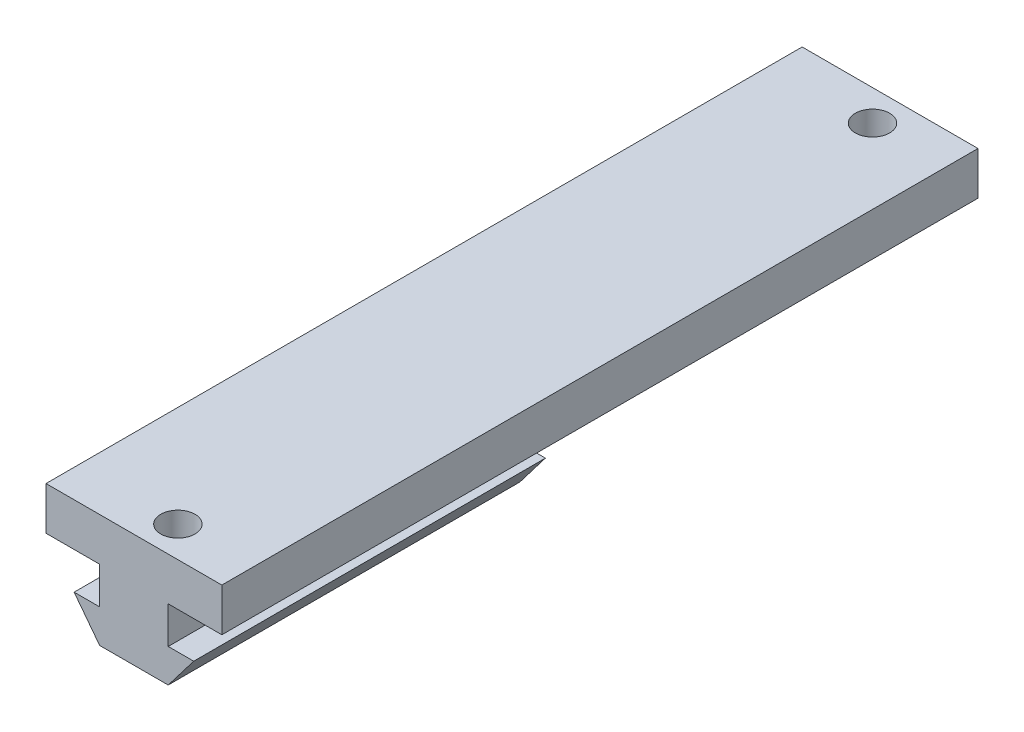
ISO-10303-21;
HEADER;
FILE_DESCRIPTION(('STEP AP214'),'2;1');
FILE_NAME('part.step','',(''),(''),'','','');
FILE_SCHEMA(('AUTOMOTIVE_DESIGN { 1 0 10303 214 1 1 1 1 }'));
ENDSEC;
DATA;
#1=APPLICATION_CONTEXT('core data for automotive mechanical design processes');
#2=APPLICATION_PROTOCOL_DEFINITION('international standard','automotive_design',2000,#1);
#3=PRODUCT_CONTEXT('',#1,'mechanical');
#4=PRODUCT('Part','Part','',(#3));
#5=PRODUCT_RELATED_PRODUCT_CATEGORY('part','',(#4));
#6=PRODUCT_DEFINITION_FORMATION('','',#4);
#7=PRODUCT_DEFINITION_CONTEXT('part definition',#1,'design');
#8=PRODUCT_DEFINITION('design','',#6,#7);
#9=PRODUCT_DEFINITION_SHAPE('','',#8);
#10=(LENGTH_UNIT() NAMED_UNIT(*) SI_UNIT(.MILLI.,.METRE.));
#11=(NAMED_UNIT(*) PLANE_ANGLE_UNIT() SI_UNIT($,.RADIAN.));
#12=(NAMED_UNIT(*) SI_UNIT($,.STERADIAN.) SOLID_ANGLE_UNIT());
#13=UNCERTAINTY_MEASURE_WITH_UNIT(LENGTH_MEASURE(1.E-05),#10,'distance_accuracy_value','');
#14=(GEOMETRIC_REPRESENTATION_CONTEXT(3) GLOBAL_UNCERTAINTY_ASSIGNED_CONTEXT((#13)) GLOBAL_UNIT_ASSIGNED_CONTEXT((#10,
#11,#12)) REPRESENTATION_CONTEXT('',''));
#15=CARTESIAN_POINT('',(0.,0.,0.));
#16=DIRECTION('',(0.,0.,1.));
#17=DIRECTION('',(1.,0.,0.));
#18=AXIS2_PLACEMENT_3D('',#15,#16,#17);
#19=CARTESIAN_POINT('',(10.,4.9,43.));
#20=DIRECTION('',(-1.,0.,0.));
#21=DIRECTION('',(0.,0.,1.));
#22=AXIS2_PLACEMENT_3D('',#19,#20,#21);
#23=PLANE('',#22);
#24=DIRECTION('',(0.,0.,-1.));
#25=VECTOR('',#24,1.);
#26=CARTESIAN_POINT('',(10.,0.,43.));
#27=LINE('',#26,#25);
#28=CARTESIAN_POINT('',(10.,0.,43.));
#29=VERTEX_POINT('',#28);
#30=CARTESIAN_POINT('',(10.,0.,-43.));
#31=VERTEX_POINT('',#30);
#32=EDGE_CURVE('E203',#29,#31,#27,.T.);
#33=ORIENTED_EDGE('',*,*,#32,.T.);
#34=DIRECTION('',(0.,-1.,0.));
#35=VECTOR('',#34,1.);
#36=CARTESIAN_POINT('',(10.,4.9,-43.));
#37=LINE('',#36,#35);
#38=CARTESIAN_POINT('',(10.,4.9,-43.));
#39=VERTEX_POINT('',#38);
#40=EDGE_CURVE('E11',#39,#31,#37,.T.);
#41=ORIENTED_EDGE('',*,*,#40,.F.);
#42=DIRECTION('',(0.,0.,-1.));
#43=VECTOR('',#42,1.);
#44=CARTESIAN_POINT('',(10.,4.9,43.));
#45=LINE('',#44,#43);
#46=CARTESIAN_POINT('',(10.,4.9,43.));
#47=VERTEX_POINT('',#46);
#48=EDGE_CURVE('E215',#47,#39,#45,.T.);
#49=ORIENTED_EDGE('',*,*,#48,.F.);
#50=DIRECTION('',(0.,-1.,0.));
#51=VECTOR('',#50,1.);
#52=CARTESIAN_POINT('',(10.,4.9,43.));
#53=LINE('',#52,#51);
#54=EDGE_CURVE('E222',#47,#29,#53,.T.);
#55=ORIENTED_EDGE('',*,*,#54,.T.);
#56=EDGE_LOOP('',(#33,#41,#49,#55));
#57=FACE_BOUND('',#56,.T.);
#58=ADVANCED_FACE('F45',(#57),#23,.F.);
#59=CARTESIAN_POINT('',(-10.,4.9,-43.));
#60=DIRECTION('',(0.,0.,1.));
#61=DIRECTION('',(1.,0.,0.));
#62=AXIS2_PLACEMENT_3D('',#59,#60,#61);
#63=PLANE('',#62);
#64=DIRECTION('',(-1.,0.,0.));
#65=VECTOR('',#64,1.);
#66=CARTESIAN_POINT('',(-10.,0.,-43.));
#67=LINE('',#66,#65);
#68=CARTESIAN_POINT('',(-10.,0.,-43.));
#69=VERTEX_POINT('',#68);
#70=EDGE_CURVE('E225',#31,#69,#67,.T.);
#71=ORIENTED_EDGE('',*,*,#70,.T.);
#72=DIRECTION('',(0.,-1.,0.));
#73=VECTOR('',#72,1.);
#74=CARTESIAN_POINT('',(-10.,4.9,-43.));
#75=LINE('',#74,#73);
#76=CARTESIAN_POINT('',(-10.,4.9,-43.));
#77=VERTEX_POINT('',#76);
#78=EDGE_CURVE('E53',#77,#69,#75,.T.);
#79=ORIENTED_EDGE('',*,*,#78,.F.);
#80=DIRECTION('',(-1.,0.,0.));
#81=VECTOR('',#80,1.);
#82=CARTESIAN_POINT('',(-10.,4.9,-43.));
#83=LINE('',#82,#81);
#84=EDGE_CURVE('E97',#39,#77,#83,.T.);
#85=ORIENTED_EDGE('',*,*,#84,.F.);
#86=ORIENTED_EDGE('',*,*,#40,.T.);
#87=EDGE_LOOP('',(#71,#79,#85,#86));
#88=FACE_BOUND('',#87,.T.);
#89=ADVANCED_FACE('F262',(#88),#63,.F.);
#90=CARTESIAN_POINT('',(-10.,4.9,43.));
#91=DIRECTION('',(1.,0.,0.));
#92=DIRECTION('',(0.,0.,-1.));
#93=AXIS2_PLACEMENT_3D('',#90,#91,#92);
#94=PLANE('',#93);
#95=DIRECTION('',(0.,0.,1.));
#96=VECTOR('',#95,1.);
#97=CARTESIAN_POINT('',(-10.,0.,43.));
#98=LINE('',#97,#96);
#99=CARTESIAN_POINT('',(-10.,0.,43.));
#100=VERTEX_POINT('',#99);
#101=EDGE_CURVE('E227',#69,#100,#98,.T.);
#102=ORIENTED_EDGE('',*,*,#101,.T.);
#103=DIRECTION('',(0.,-1.,0.));
#104=VECTOR('',#103,1.);
#105=CARTESIAN_POINT('',(-10.,4.9,43.));
#106=LINE('',#105,#104);
#107=CARTESIAN_POINT('',(-10.,4.9,43.));
#108=VERTEX_POINT('',#107);
#109=EDGE_CURVE('E231',#108,#100,#106,.T.);
#110=ORIENTED_EDGE('',*,*,#109,.F.);
#111=DIRECTION('',(0.,0.,1.));
#112=VECTOR('',#111,1.);
#113=CARTESIAN_POINT('',(-10.,4.9,43.));
#114=LINE('',#113,#112);
#115=EDGE_CURVE('E219',#77,#108,#114,.T.);
#116=ORIENTED_EDGE('',*,*,#115,.F.);
#117=ORIENTED_EDGE('',*,*,#78,.T.);
#118=EDGE_LOOP('',(#102,#110,#116,#117));
#119=FACE_BOUND('',#118,.T.);
#120=ADVANCED_FACE('F238',(#119),#94,.F.);
#121=CARTESIAN_POINT('',(-10.,4.9,43.));
#122=DIRECTION('',(0.,0.,-1.));
#123=DIRECTION('',(-1.,0.,0.));
#124=AXIS2_PLACEMENT_3D('',#121,#122,#123);
#125=PLANE('',#124);
#126=DIRECTION('',(1.,0.,0.));
#127=VECTOR('',#126,1.);
#128=CARTESIAN_POINT('',(-10.,0.,43.));
#129=LINE('',#128,#127);
#130=CARTESIAN_POINT('',(-3.90000000000001,0.,43.));
#131=VERTEX_POINT('',#130);
#132=EDGE_CURVE('E217',#100,#131,#129,.T.);
#133=ORIENTED_EDGE('',*,*,#132,.T.);
#134=DIRECTION('',(0.,-1.,0.));
#135=VECTOR('',#134,1.);
#136=CARTESIAN_POINT('',(-3.90000000000001,0.,43.));
#137=LINE('',#136,#135);
#138=CARTESIAN_POINT('',(-3.90000000000001,-4.2,43.));
#139=VERTEX_POINT('',#138);
#140=EDGE_CURVE('E60',#131,#139,#137,.T.);
#141=ORIENTED_EDGE('',*,*,#140,.T.);
#142=DIRECTION('',(-1.,0.,0.));
#143=VECTOR('',#142,1.);
#144=CARTESIAN_POINT('',(-3.90000000000001,-4.2,43.));
#145=LINE('',#144,#143);
#146=CARTESIAN_POINT('',(-6.80000000000001,-4.2,43.));
#147=VERTEX_POINT('',#146);
#148=EDGE_CURVE('E188',#139,#147,#145,.T.);
#149=ORIENTED_EDGE('',*,*,#148,.T.);
#150=DIRECTION('',(0.606673319350191,-0.794951246045077,0.));
#151=VECTOR('',#150,1.);
#152=CARTESIAN_POINT('',(-6.80000000000001,-4.2,43.));
#153=LINE('',#152,#151);
#154=CARTESIAN_POINT('',(-3.90000000000001,-8.,43.));
#155=VERTEX_POINT('',#154);
#156=EDGE_CURVE('E191',#147,#155,#153,.T.);
#157=ORIENTED_EDGE('',*,*,#156,.T.);
#158=DIRECTION('',(1.,0.,0.));
#159=VECTOR('',#158,1.);
#160=CARTESIAN_POINT('',(-3.90000000000001,-8.,43.));
#161=LINE('',#160,#159);
#162=CARTESIAN_POINT('',(3.89999999999999,-8.,43.));
#163=VERTEX_POINT('',#162);
#164=EDGE_CURVE('E194',#155,#163,#161,.T.);
#165=ORIENTED_EDGE('',*,*,#164,.T.);
#166=DIRECTION('',(0.606673319350191,0.794951246045077,0.));
#167=VECTOR('',#166,1.);
#168=CARTESIAN_POINT('',(3.89999999999999,-8.,43.));
#169=LINE('',#168,#167);
#170=CARTESIAN_POINT('',(6.79999999999999,-4.2,43.));
#171=VERTEX_POINT('',#170);
#172=EDGE_CURVE('E197',#163,#171,#169,.T.);
#173=ORIENTED_EDGE('',*,*,#172,.T.);
#174=DIRECTION('',(-1.,0.,0.));
#175=VECTOR('',#174,1.);
#176=CARTESIAN_POINT('',(6.79999999999999,-4.2,43.));
#177=LINE('',#176,#175);
#178=CARTESIAN_POINT('',(3.89999999999999,-4.2,43.));
#179=VERTEX_POINT('',#178);
#180=EDGE_CURVE('E167',#171,#179,#177,.T.);
#181=ORIENTED_EDGE('',*,*,#180,.T.);
#182=DIRECTION('',(0.,1.,0.));
#183=VECTOR('',#182,1.);
#184=CARTESIAN_POINT('',(3.89999999999999,-4.2,43.));
#185=LINE('',#184,#183);
#186=CARTESIAN_POINT('',(3.89999999999998,0.,43.));
#187=VERTEX_POINT('',#186);
#188=EDGE_CURVE('E165',#179,#187,#185,.T.);
#189=ORIENTED_EDGE('',*,*,#188,.T.);
#190=EDGE_CURVE('E90',#187,#29,#129,.T.);
#191=ORIENTED_EDGE('',*,*,#190,.T.);
#192=ORIENTED_EDGE('',*,*,#54,.F.);
#193=DIRECTION('',(1.,0.,0.));
#194=VECTOR('',#193,1.);
#195=CARTESIAN_POINT('',(-10.,4.9,43.));
#196=LINE('',#195,#194);
#197=EDGE_CURVE('E69',#108,#47,#196,.T.);
#198=ORIENTED_EDGE('',*,*,#197,.F.);
#199=ORIENTED_EDGE('',*,*,#109,.T.);
#200=EDGE_LOOP('',(#133,#141,#149,#157,#165,#173,#181,#189,#191,#192,#198,#199));
#201=FACE_BOUND('',#200,.T.);
#202=ADVANCED_FACE('F241',(#201),#125,.F.);
#203=CARTESIAN_POINT('',(0.,4.9,0.));
#204=DIRECTION('',(0.,-1.,0.));
#205=DIRECTION('',(0.,0.,-1.));
#206=AXIS2_PLACEMENT_3D('',#203,#204,#205);
#207=PLANE('',#206);
#208=CARTESIAN_POINT('',(1.49999999999999,4.9,39.5));
#209=DIRECTION('',(0.,1.,0.));
#210=DIRECTION('',(0.,0.,1.));
#211=AXIS2_PLACEMENT_3D('',#208,#209,#210);
#212=CIRCLE('',#211,1.95);
#213=CARTESIAN_POINT('',(1.49999999999999,4.9,41.45));
#214=VERTEX_POINT('',#213);
#215=EDGE_CURVE('E380',#214,#214,#212,.T.);
#216=ORIENTED_EDGE('',*,*,#215,.F.);
#217=EDGE_LOOP('',(#216));
#218=FACE_BOUND('',#217,.T.);
#219=CARTESIAN_POINT('',(1.49999999999998,4.9,-39.5));
#220=DIRECTION('',(0.,1.,0.));
#221=DIRECTION('',(0.,0.,1.));
#222=AXIS2_PLACEMENT_3D('',#219,#220,#221);
#223=CIRCLE('',#222,1.95);
#224=CARTESIAN_POINT('',(1.49999999999998,4.9,-37.55));
#225=VERTEX_POINT('',#224);
#226=EDGE_CURVE('E170',#225,#225,#223,.T.);
#227=ORIENTED_EDGE('',*,*,#226,.F.);
#228=EDGE_LOOP('',(#227));
#229=FACE_BOUND('',#228,.T.);
#230=ORIENTED_EDGE('',*,*,#48,.T.);
#231=ORIENTED_EDGE('',*,*,#84,.T.);
#232=ORIENTED_EDGE('',*,*,#115,.T.);
#233=ORIENTED_EDGE('',*,*,#197,.T.);
#234=EDGE_LOOP('',(#230,#231,#232,#233));
#235=FACE_BOUND('',#234,.T.);
#236=ADVANCED_FACE('F245',(#218,#229,#235),#207,.F.);
#237=CARTESIAN_POINT('',(0.,0.,0.));
#238=DIRECTION('',(0.,-1.,0.));
#239=DIRECTION('',(0.,0.,-1.));
#240=AXIS2_PLACEMENT_3D('',#237,#238,#239);
#241=PLANE('',#240);
#242=CARTESIAN_POINT('',(1.49999999999998,0.,-39.5));
#243=DIRECTION('',(0.,-1.,0.));
#244=DIRECTION('',(0.,0.,-1.));
#245=AXIS2_PLACEMENT_3D('',#242,#243,#244);
#246=CIRCLE('',#245,1.95);
#247=CARTESIAN_POINT('',(1.49999999999998,0.,-41.45));
#248=VERTEX_POINT('',#247);
#249=EDGE_CURVE('E48',#248,#248,#246,.T.);
#250=ORIENTED_EDGE('',*,*,#249,.F.);
#251=EDGE_LOOP('',(#250));
#252=FACE_BOUND('',#251,.T.);
#253=DIRECTION('',(0.,0.,1.));
#254=VECTOR('',#253,1.);
#255=CARTESIAN_POINT('',(3.89999999999998,0.,2.99999999999999));
#256=LINE('',#255,#254);
#257=CARTESIAN_POINT('',(3.89999999999998,0.,2.99999999999999));
#258=VERTEX_POINT('',#257);
#259=EDGE_CURVE('E164',#258,#187,#256,.T.);
#260=ORIENTED_EDGE('',*,*,#259,.F.);
#261=DIRECTION('',(-1.,0.,0.));
#262=VECTOR('',#261,1.);
#263=CARTESIAN_POINT('',(-3.90000000000001,0.,2.99999999999999));
#264=LINE('',#263,#262);
#265=CARTESIAN_POINT('',(-3.90000000000001,0.,2.99999999999999));
#266=VERTEX_POINT('',#265);
#267=EDGE_CURVE('E156',#258,#266,#264,.T.);
#268=ORIENTED_EDGE('',*,*,#267,.T.);
#269=DIRECTION('',(0.,0.,1.));
#270=VECTOR('',#269,1.);
#271=CARTESIAN_POINT('',(-3.90000000000001,0.,2.99999999999999));
#272=LINE('',#271,#270);
#273=EDGE_CURVE('E141',#266,#131,#272,.T.);
#274=ORIENTED_EDGE('',*,*,#273,.T.);
#275=ORIENTED_EDGE('',*,*,#132,.F.);
#276=ORIENTED_EDGE('',*,*,#101,.F.);
#277=ORIENTED_EDGE('',*,*,#70,.F.);
#278=ORIENTED_EDGE('',*,*,#32,.F.);
#279=ORIENTED_EDGE('',*,*,#190,.F.);
#280=EDGE_LOOP('',(#260,#268,#274,#275,#276,#277,#278,#279));
#281=FACE_BOUND('',#280,.T.);
#282=ADVANCED_FACE('F163',(#252,#281),#241,.T.);
#283=CARTESIAN_POINT('',(3.89999999999999,-4.2,2.99999999999999));
#284=DIRECTION('',(1.,0.,0.));
#285=DIRECTION('',(0.,1.,0.));
#286=AXIS2_PLACEMENT_3D('',#283,#284,#285);
#287=PLANE('',#286);
#288=ORIENTED_EDGE('',*,*,#188,.F.);
#289=DIRECTION('',(0.,0.,1.));
#290=VECTOR('',#289,1.);
#291=CARTESIAN_POINT('',(3.89999999999999,-4.2,2.99999999999999));
#292=LINE('',#291,#290);
#293=CARTESIAN_POINT('',(3.89999999999999,-4.2,2.99999999999999));
#294=VERTEX_POINT('',#293);
#295=EDGE_CURVE('E204',#294,#179,#292,.T.);
#296=ORIENTED_EDGE('',*,*,#295,.F.);
#297=DIRECTION('',(0.,1.,0.));
#298=VECTOR('',#297,1.);
#299=CARTESIAN_POINT('',(3.89999999999999,-4.2,2.99999999999999));
#300=LINE('',#299,#298);
#301=EDGE_CURVE('E150',#294,#258,#300,.T.);
#302=ORIENTED_EDGE('',*,*,#301,.T.);
#303=ORIENTED_EDGE('',*,*,#259,.T.);
#304=EDGE_LOOP('',(#288,#296,#302,#303));
#305=FACE_BOUND('',#304,.T.);
#306=ADVANCED_FACE('F253',(#305),#287,.T.);
#307=CARTESIAN_POINT('',(6.79999999999999,-4.2,2.99999999999999));
#308=DIRECTION('',(0.,1.,0.));
#309=DIRECTION('',(0.,0.,1.));
#310=AXIS2_PLACEMENT_3D('',#307,#308,#309);
#311=PLANE('',#310);
#312=ORIENTED_EDGE('',*,*,#180,.F.);
#313=DIRECTION('',(0.,0.,1.));
#314=VECTOR('',#313,1.);
#315=CARTESIAN_POINT('',(6.79999999999999,-4.2,2.99999999999999));
#316=LINE('',#315,#314);
#317=CARTESIAN_POINT('',(6.79999999999999,-4.2,2.99999999999999));
#318=VERTEX_POINT('',#317);
#319=EDGE_CURVE('E206',#318,#171,#316,.T.);
#320=ORIENTED_EDGE('',*,*,#319,.F.);
#321=DIRECTION('',(-1.,0.,0.));
#322=VECTOR('',#321,1.);
#323=CARTESIAN_POINT('',(6.79999999999999,-4.2,2.99999999999999));
#324=LINE('',#323,#322);
#325=EDGE_CURVE('E183',#318,#294,#324,.T.);
#326=ORIENTED_EDGE('',*,*,#325,.T.);
#327=ORIENTED_EDGE('',*,*,#295,.T.);
#328=EDGE_LOOP('',(#312,#320,#326,#327));
#329=FACE_BOUND('',#328,.T.);
#330=ADVANCED_FACE('F285',(#329),#311,.T.);
#331=CARTESIAN_POINT('',(3.89999999999999,-8.,2.99999999999999));
#332=DIRECTION('',(0.794951246045077,-0.606673319350191,0.));
#333=DIRECTION('',(0.606673319350191,0.794951246045077,0.));
#334=AXIS2_PLACEMENT_3D('',#331,#332,#333);
#335=PLANE('',#334);
#336=ORIENTED_EDGE('',*,*,#172,.F.);
#337=DIRECTION('',(0.,0.,1.));
#338=VECTOR('',#337,1.);
#339=CARTESIAN_POINT('',(3.89999999999999,-8.,2.99999999999999));
#340=LINE('',#339,#338);
#341=CARTESIAN_POINT('',(3.89999999999999,-8.,2.99999999999999));
#342=VERTEX_POINT('',#341);
#343=EDGE_CURVE('E208',#342,#163,#340,.T.);
#344=ORIENTED_EDGE('',*,*,#343,.F.);
#345=DIRECTION('',(0.606673319350191,0.794951246045077,0.));
#346=VECTOR('',#345,1.);
#347=CARTESIAN_POINT('',(3.89999999999999,-8.,2.99999999999999));
#348=LINE('',#347,#346);
#349=EDGE_CURVE('E180',#342,#318,#348,.T.);
#350=ORIENTED_EDGE('',*,*,#349,.T.);
#351=ORIENTED_EDGE('',*,*,#319,.T.);
#352=EDGE_LOOP('',(#336,#344,#350,#351));
#353=FACE_BOUND('',#352,.T.);
#354=ADVANCED_FACE('F294',(#353),#335,.T.);
#355=CARTESIAN_POINT('',(-3.90000000000001,-8.,2.99999999999999));
#356=DIRECTION('',(0.,-1.,0.));
#357=DIRECTION('',(1.,0.,0.));
#358=AXIS2_PLACEMENT_3D('',#355,#356,#357);
#359=PLANE('',#358);
#360=ORIENTED_EDGE('',*,*,#164,.F.);
#361=DIRECTION('',(0.,0.,1.));
#362=VECTOR('',#361,1.);
#363=CARTESIAN_POINT('',(-3.90000000000001,-8.,2.99999999999999));
#364=LINE('',#363,#362);
#365=CARTESIAN_POINT('',(-3.90000000000001,-8.,2.99999999999999));
#366=VERTEX_POINT('',#365);
#367=EDGE_CURVE('E210',#366,#155,#364,.T.);
#368=ORIENTED_EDGE('',*,*,#367,.F.);
#369=DIRECTION('',(1.,0.,0.));
#370=VECTOR('',#369,1.);
#371=CARTESIAN_POINT('',(-3.90000000000001,-8.,2.99999999999999));
#372=LINE('',#371,#370);
#373=EDGE_CURVE('E177',#366,#342,#372,.T.);
#374=ORIENTED_EDGE('',*,*,#373,.T.);
#375=ORIENTED_EDGE('',*,*,#343,.T.);
#376=EDGE_LOOP('',(#360,#368,#374,#375));
#377=FACE_BOUND('',#376,.T.);
#378=ADVANCED_FACE('F303',(#377),#359,.T.);
#379=CARTESIAN_POINT('',(-6.80000000000001,-4.2,2.99999999999999));
#380=DIRECTION('',(-0.794951246045077,-0.606673319350191,0.));
#381=DIRECTION('',(0.606673319350191,-0.794951246045077,0.));
#382=AXIS2_PLACEMENT_3D('',#379,#380,#381);
#383=PLANE('',#382);
#384=ORIENTED_EDGE('',*,*,#156,.F.);
#385=DIRECTION('',(0.,0.,1.));
#386=VECTOR('',#385,1.);
#387=CARTESIAN_POINT('',(-6.80000000000001,-4.2,2.99999999999999));
#388=LINE('',#387,#386);
#389=CARTESIAN_POINT('',(-6.80000000000001,-4.2,2.99999999999999));
#390=VERTEX_POINT('',#389);
#391=EDGE_CURVE('E212',#390,#147,#388,.T.);
#392=ORIENTED_EDGE('',*,*,#391,.F.);
#393=DIRECTION('',(0.606673319350191,-0.794951246045077,0.));
#394=VECTOR('',#393,1.);
#395=CARTESIAN_POINT('',(-6.80000000000001,-4.2,2.99999999999999));
#396=LINE('',#395,#394);
#397=EDGE_CURVE('E174',#390,#366,#396,.T.);
#398=ORIENTED_EDGE('',*,*,#397,.T.);
#399=ORIENTED_EDGE('',*,*,#367,.T.);
#400=EDGE_LOOP('',(#384,#392,#398,#399));
#401=FACE_BOUND('',#400,.T.);
#402=ADVANCED_FACE('F312',(#401),#383,.T.);
#403=CARTESIAN_POINT('',(-3.90000000000001,-4.2,2.99999999999999));
#404=DIRECTION('',(0.,1.,0.));
#405=DIRECTION('',(-1.,0.,0.));
#406=AXIS2_PLACEMENT_3D('',#403,#404,#405);
#407=PLANE('',#406);
#408=ORIENTED_EDGE('',*,*,#148,.F.);
#409=DIRECTION('',(0.,0.,1.));
#410=VECTOR('',#409,1.);
#411=CARTESIAN_POINT('',(-3.90000000000001,-4.2,2.99999999999999));
#412=LINE('',#411,#410);
#413=CARTESIAN_POINT('',(-3.90000000000001,-4.2,2.99999999999999));
#414=VERTEX_POINT('',#413);
#415=EDGE_CURVE('E149',#414,#139,#412,.T.);
#416=ORIENTED_EDGE('',*,*,#415,.F.);
#417=DIRECTION('',(-1.,0.,0.));
#418=VECTOR('',#417,1.);
#419=CARTESIAN_POINT('',(-3.90000000000001,-4.2,2.99999999999999));
#420=LINE('',#419,#418);
#421=EDGE_CURVE('E160',#414,#390,#420,.T.);
#422=ORIENTED_EDGE('',*,*,#421,.T.);
#423=ORIENTED_EDGE('',*,*,#391,.T.);
#424=EDGE_LOOP('',(#408,#416,#422,#423));
#425=FACE_BOUND('',#424,.T.);
#426=ADVANCED_FACE('F321',(#425),#407,.T.);
#427=CARTESIAN_POINT('',(-3.90000000000001,0.,2.99999999999999));
#428=DIRECTION('',(-1.,0.,0.));
#429=DIRECTION('',(0.,-1.,0.));
#430=AXIS2_PLACEMENT_3D('',#427,#428,#429);
#431=PLANE('',#430);
#432=ORIENTED_EDGE('',*,*,#140,.F.);
#433=ORIENTED_EDGE('',*,*,#273,.F.);
#434=DIRECTION('',(0.,-1.,0.));
#435=VECTOR('',#434,1.);
#436=CARTESIAN_POINT('',(-3.90000000000001,0.,2.99999999999999));
#437=LINE('',#436,#435);
#438=EDGE_CURVE('E144',#266,#414,#437,.T.);
#439=ORIENTED_EDGE('',*,*,#438,.T.);
#440=ORIENTED_EDGE('',*,*,#415,.T.);
#441=EDGE_LOOP('',(#432,#433,#439,#440));
#442=FACE_BOUND('',#441,.T.);
#443=ADVANCED_FACE('F143',(#442),#431,.T.);
#444=CARTESIAN_POINT('',(0.,0.,2.99999999999999));
#445=DIRECTION('',(0.,0.,1.));
#446=DIRECTION('',(1.,0.,0.));
#447=AXIS2_PLACEMENT_3D('',#444,#445,#446);
#448=PLANE('',#447);
#449=ORIENTED_EDGE('',*,*,#267,.F.);
#450=ORIENTED_EDGE('',*,*,#301,.F.);
#451=ORIENTED_EDGE('',*,*,#325,.F.);
#452=ORIENTED_EDGE('',*,*,#349,.F.);
#453=ORIENTED_EDGE('',*,*,#373,.F.);
#454=ORIENTED_EDGE('',*,*,#397,.F.);
#455=ORIENTED_EDGE('',*,*,#421,.F.);
#456=ORIENTED_EDGE('',*,*,#438,.F.);
#457=EDGE_LOOP('',(#449,#450,#451,#452,#453,#454,#455,#456));
#458=FACE_BOUND('',#457,.T.);
#459=ADVANCED_FACE('F154',(#458),#448,.F.);
#460=CARTESIAN_POINT('',(1.49999999999998,-1.1,-39.5));
#461=DIRECTION('',(0.,1.,0.));
#462=DIRECTION('',(0.,0.,1.));
#463=AXIS2_PLACEMENT_3D('',#460,#461,#462);
#464=CYLINDRICAL_SURFACE('',#463,1.95);
#465=ORIENTED_EDGE('',*,*,#249,.T.);
#466=EDGE_LOOP('',(#465));
#467=FACE_BOUND('',#466,.T.);
#468=ORIENTED_EDGE('',*,*,#226,.T.);
#469=EDGE_LOOP('',(#468));
#470=FACE_BOUND('',#469,.T.);
#471=ADVANCED_FACE('F342',(#467,#470),#464,.F.);
#472=CARTESIAN_POINT('',(1.49999999999999,-1.1,39.5));
#473=DIRECTION('',(0.,1.,0.));
#474=DIRECTION('',(0.,0.,1.));
#475=AXIS2_PLACEMENT_3D('',#472,#473,#474);
#476=CYLINDRICAL_SURFACE('',#475,1.95);
#477=CARTESIAN_POINT('',(1.49999999999999,-1.1,39.5));
#478=DIRECTION('',(0.,1.,0.));
#479=DIRECTION('',(0.,0.,1.));
#480=AXIS2_PLACEMENT_3D('',#477,#478,#479);
#481=CIRCLE('',#480,1.95);
#482=CARTESIAN_POINT('',(1.49999999999999,-1.1,41.45));
#483=VERTEX_POINT('',#482);
#484=EDGE_CURVE('E379',#483,#483,#481,.T.);
#485=ORIENTED_EDGE('',*,*,#484,.F.);
#486=EDGE_LOOP('',(#485));
#487=FACE_BOUND('',#486,.T.);
#488=ORIENTED_EDGE('',*,*,#215,.T.);
#489=EDGE_LOOP('',(#488));
#490=FACE_BOUND('',#489,.T.);
#491=ADVANCED_FACE('F354',(#487,#490),#476,.F.);
#492=CARTESIAN_POINT('',(1.49999999999999,-1.1,39.5));
#493=DIRECTION('',(0.,1.,0.));
#494=DIRECTION('',(0.,0.,1.));
#495=AXIS2_PLACEMENT_3D('',#492,#493,#494);
#496=PLANE('',#495);
#497=ORIENTED_EDGE('',*,*,#484,.T.);
#498=EDGE_LOOP('',(#497));
#499=FACE_BOUND('',#498,.T.);
#500=ADVANCED_FACE('F364',(#499),#496,.T.);
#501=CLOSED_SHELL('',(#58,#89,#120,#202,#236,#282,#306,#330,#354,#378,#402,#426,#443,#459,#471,
#491,#500));
#502=MANIFOLD_SOLID_BREP('B2',#501);
#503=ADVANCED_BREP_SHAPE_REPRESENTATION('',(#18,#502),#14);
#504=SHAPE_DEFINITION_REPRESENTATION(#9,#503);
ENDSEC;
END-ISO-10303-21;
